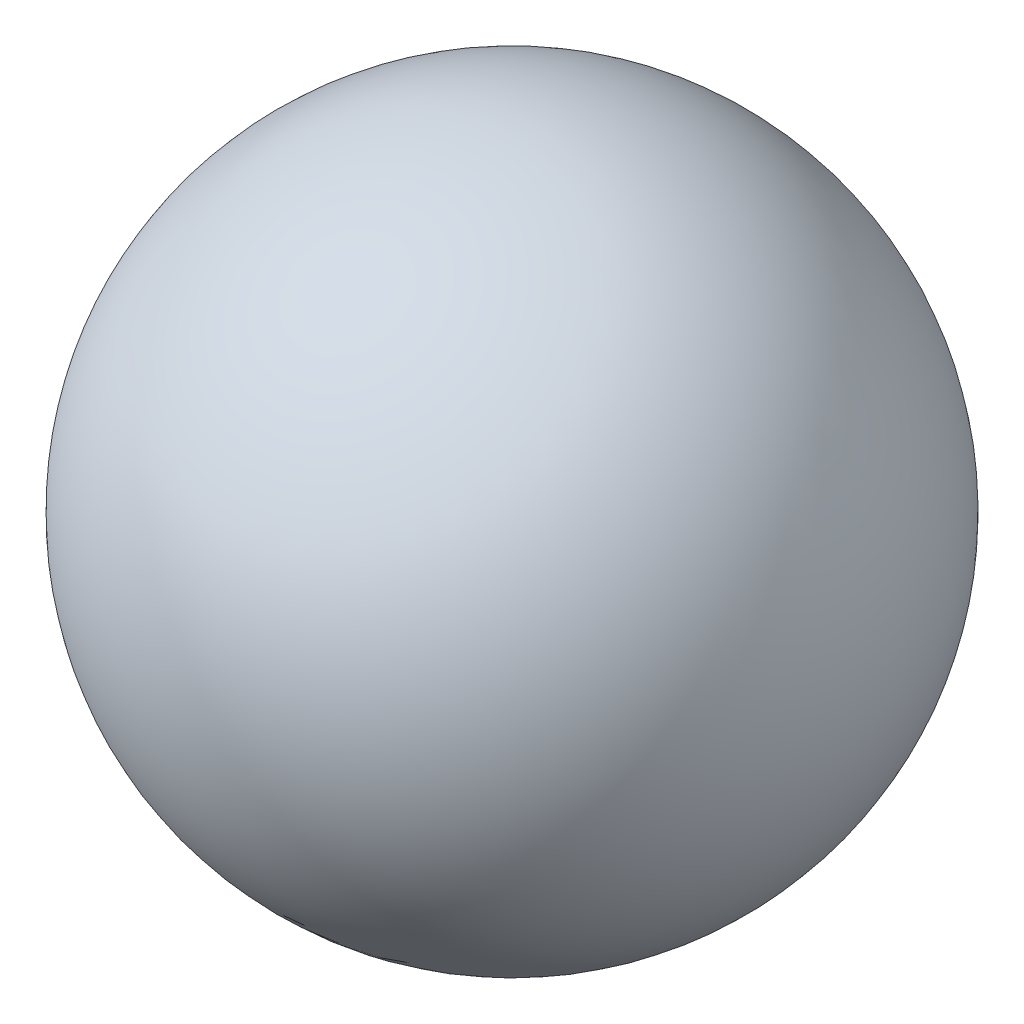
ISO-10303-21;
HEADER;
FILE_DESCRIPTION(('STEP AP214'),'2;1');
FILE_NAME('part.step','',(''),(''),'','','');
FILE_SCHEMA(('AUTOMOTIVE_DESIGN { 1 0 10303 214 1 1 1 1 }'));
ENDSEC;
DATA;
#1=APPLICATION_CONTEXT('core data for automotive mechanical design processes');
#2=APPLICATION_PROTOCOL_DEFINITION('international standard','automotive_design',2000,#1);
#3=PRODUCT_CONTEXT('',#1,'mechanical');
#4=PRODUCT('Part','Part','',(#3));
#5=PRODUCT_RELATED_PRODUCT_CATEGORY('part','',(#4));
#6=PRODUCT_DEFINITION_FORMATION('','',#4);
#7=PRODUCT_DEFINITION_CONTEXT('part definition',#1,'design');
#8=PRODUCT_DEFINITION('design','',#6,#7);
#9=PRODUCT_DEFINITION_SHAPE('','',#8);
#10=(LENGTH_UNIT() NAMED_UNIT(*) SI_UNIT(.MILLI.,.METRE.));
#11=(NAMED_UNIT(*) PLANE_ANGLE_UNIT() SI_UNIT($,.RADIAN.));
#12=(NAMED_UNIT(*) SI_UNIT($,.STERADIAN.) SOLID_ANGLE_UNIT());
#13=UNCERTAINTY_MEASURE_WITH_UNIT(LENGTH_MEASURE(1.E-05),#10,'distance_accuracy_value','');
#14=(GEOMETRIC_REPRESENTATION_CONTEXT(3) GLOBAL_UNCERTAINTY_ASSIGNED_CONTEXT((#13)) GLOBAL_UNIT_ASSIGNED_CONTEXT((#10,
#11,#12)) REPRESENTATION_CONTEXT('',''));
#15=CARTESIAN_POINT('',(0.,0.,0.));
#16=DIRECTION('',(0.,0.,1.));
#17=DIRECTION('',(1.,0.,0.));
#18=AXIS2_PLACEMENT_3D('',#15,#16,#17);
#19=CARTESIAN_POINT('',(67.76,43.2932727080139,54.1735017742027));
#20=DIRECTION('',(0.,0.624294642316075,0.781188965344138));
#21=DIRECTION('',(0.173648177666934,-0.769320949638491,0.614810203916853));
#22=AXIS2_PLACEMENT_3D('',#19,#20,#21);
#23=SPHERICAL_SURFACE('',#22,7.15);
#24=CARTESIAN_POINT('',(67.76,47.7569794005738,59.7590028764133));
#25=VERTEX_POINT('',#24);
#26=VERTEX_LOOP('',#25);
#27=FACE_BOUND('',#26,.T.);
#28=CARTESIAN_POINT('',(67.76,38.829566015454,48.5880006719921));
#29=VERTEX_POINT('',#28);
#30=VERTEX_LOOP('',#29);
#31=FACE_BOUND('',#30,.T.);
#32=ADVANCED_FACE('F16',(#27,#31),#23,.T.);
#33=CLOSED_SHELL('',(#32));
#34=MANIFOLD_SOLID_BREP('B1',#33);
#35=ADVANCED_BREP_SHAPE_REPRESENTATION('',(#18,#34),#14);
#36=SHAPE_DEFINITION_REPRESENTATION(#9,#35);
ENDSEC;
END-ISO-10303-21;
